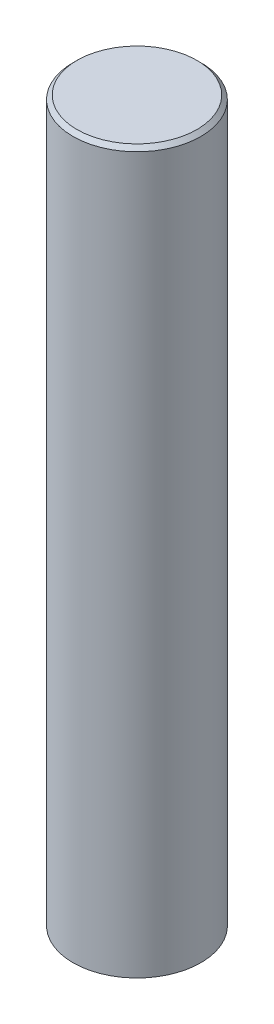
ISO-10303-21;
HEADER;
FILE_DESCRIPTION(('STEP AP214'),'2;1');
FILE_NAME('part.step','',(''),(''),'','','');
FILE_SCHEMA(('AUTOMOTIVE_DESIGN { 1 0 10303 214 1 1 1 1 }'));
ENDSEC;
DATA;
#1=APPLICATION_CONTEXT('core data for automotive mechanical design processes');
#2=APPLICATION_PROTOCOL_DEFINITION('international standard','automotive_design',2000,#1);
#3=PRODUCT_CONTEXT('',#1,'mechanical');
#4=PRODUCT('Part','Part','',(#3));
#5=PRODUCT_RELATED_PRODUCT_CATEGORY('part','',(#4));
#6=PRODUCT_DEFINITION_FORMATION('','',#4);
#7=PRODUCT_DEFINITION_CONTEXT('part definition',#1,'design');
#8=PRODUCT_DEFINITION('design','',#6,#7);
#9=PRODUCT_DEFINITION_SHAPE('','',#8);
#10=(LENGTH_UNIT() NAMED_UNIT(*) SI_UNIT(.MILLI.,.METRE.));
#11=(NAMED_UNIT(*) PLANE_ANGLE_UNIT() SI_UNIT($,.RADIAN.));
#12=(NAMED_UNIT(*) SI_UNIT($,.STERADIAN.) SOLID_ANGLE_UNIT());
#13=UNCERTAINTY_MEASURE_WITH_UNIT(LENGTH_MEASURE(1.E-05),#10,'distance_accuracy_value','');
#14=(GEOMETRIC_REPRESENTATION_CONTEXT(3) GLOBAL_UNCERTAINTY_ASSIGNED_CONTEXT((#13)) GLOBAL_UNIT_ASSIGNED_CONTEXT((#10,
#11,#12)) REPRESENTATION_CONTEXT('',''));
#15=CARTESIAN_POINT('',(0.,0.,0.));
#16=DIRECTION('',(0.,0.,1.));
#17=DIRECTION('',(1.,0.,0.));
#18=AXIS2_PLACEMENT_3D('',#15,#16,#17);
#19=CARTESIAN_POINT('',(0.,180.,0.));
#20=DIRECTION('',(0.,-1.,0.));
#21=DIRECTION('',(0.,0.,-1.));
#22=AXIS2_PLACEMENT_3D('',#19,#20,#21);
#23=CYLINDRICAL_SURFACE('',#22,16.);
#24=CARTESIAN_POINT('',(0.,179.,0.));
#25=DIRECTION('',(0.,1.,0.));
#26=DIRECTION('',(0.,0.,1.));
#27=AXIS2_PLACEMENT_3D('',#24,#25,#26);
#28=CIRCLE('',#27,16.);
#29=CARTESIAN_POINT('',(0.,179.,16.));
#30=VERTEX_POINT('',#29);
#31=EDGE_CURVE('E10',#30,#30,#28,.F.);
#32=ORIENTED_EDGE('',*,*,#31,.T.);
#33=EDGE_LOOP('',(#32));
#34=FACE_BOUND('',#33,.T.);
#35=CARTESIAN_POINT('',(0.,0.,0.));
#36=DIRECTION('',(0.,1.,0.));
#37=DIRECTION('',(0.,0.,1.));
#38=AXIS2_PLACEMENT_3D('',#35,#36,#37);
#39=CIRCLE('',#38,16.);
#40=CARTESIAN_POINT('',(0.,0.,16.));
#41=VERTEX_POINT('',#40);
#42=EDGE_CURVE('E42',#41,#41,#39,.T.);
#43=ORIENTED_EDGE('',*,*,#42,.T.);
#44=EDGE_LOOP('',(#43));
#45=FACE_BOUND('',#44,.T.);
#46=ADVANCED_FACE('F31',(#34,#45),#23,.T.);
#47=CARTESIAN_POINT('',(0.,180.,0.));
#48=DIRECTION('',(0.,1.,0.));
#49=DIRECTION('',(0.,0.,1.));
#50=AXIS2_PLACEMENT_3D('',#47,#48,#49);
#51=PLANE('',#50);
#52=CARTESIAN_POINT('',(0.,180.,0.));
#53=DIRECTION('',(0.,1.,0.));
#54=DIRECTION('',(0.,0.,1.));
#55=AXIS2_PLACEMENT_3D('',#52,#53,#54);
#56=CIRCLE('',#55,15.0000000000001);
#57=CARTESIAN_POINT('',(0.,180.,15.0000000000001));
#58=VERTEX_POINT('',#57);
#59=EDGE_CURVE('E38',#58,#58,#56,.T.);
#60=ORIENTED_EDGE('',*,*,#59,.T.);
#61=EDGE_LOOP('',(#60));
#62=FACE_BOUND('',#61,.T.);
#63=ADVANCED_FACE('F52',(#62),#51,.T.);
#64=CARTESIAN_POINT('',(0.,0.,0.));
#65=DIRECTION('',(0.,1.,0.));
#66=DIRECTION('',(0.,0.,1.));
#67=AXIS2_PLACEMENT_3D('',#64,#65,#66);
#68=PLANE('',#67);
#69=ORIENTED_EDGE('',*,*,#42,.F.);
#70=EDGE_LOOP('',(#69));
#71=FACE_BOUND('',#70,.T.);
#72=ADVANCED_FACE('F50',(#71),#68,.F.);
#73=CARTESIAN_POINT('',(0.,180.,0.));
#74=DIRECTION('',(0.,-1.,0.));
#75=DIRECTION('',(0.,0.,-1.));
#76=AXIS2_PLACEMENT_3D('',#73,#74,#75);
#77=CONICAL_SURFACE('',#76,15.0000000000001,0.785398163397429);
#78=ORIENTED_EDGE('',*,*,#31,.F.);
#79=EDGE_LOOP('',(#78));
#80=FACE_BOUND('',#79,.T.);
#81=ORIENTED_EDGE('',*,*,#59,.F.);
#82=EDGE_LOOP('',(#81));
#83=FACE_BOUND('',#82,.T.);
#84=ADVANCED_FACE('F33',(#80,#83),#77,.T.);
#85=CLOSED_SHELL('',(#46,#63,#72,#84));
#86=MANIFOLD_SOLID_BREP('B2',#85);
#87=ADVANCED_BREP_SHAPE_REPRESENTATION('',(#18,#86),#14);
#88=SHAPE_DEFINITION_REPRESENTATION(#9,#87);
ENDSEC;
END-ISO-10303-21;
